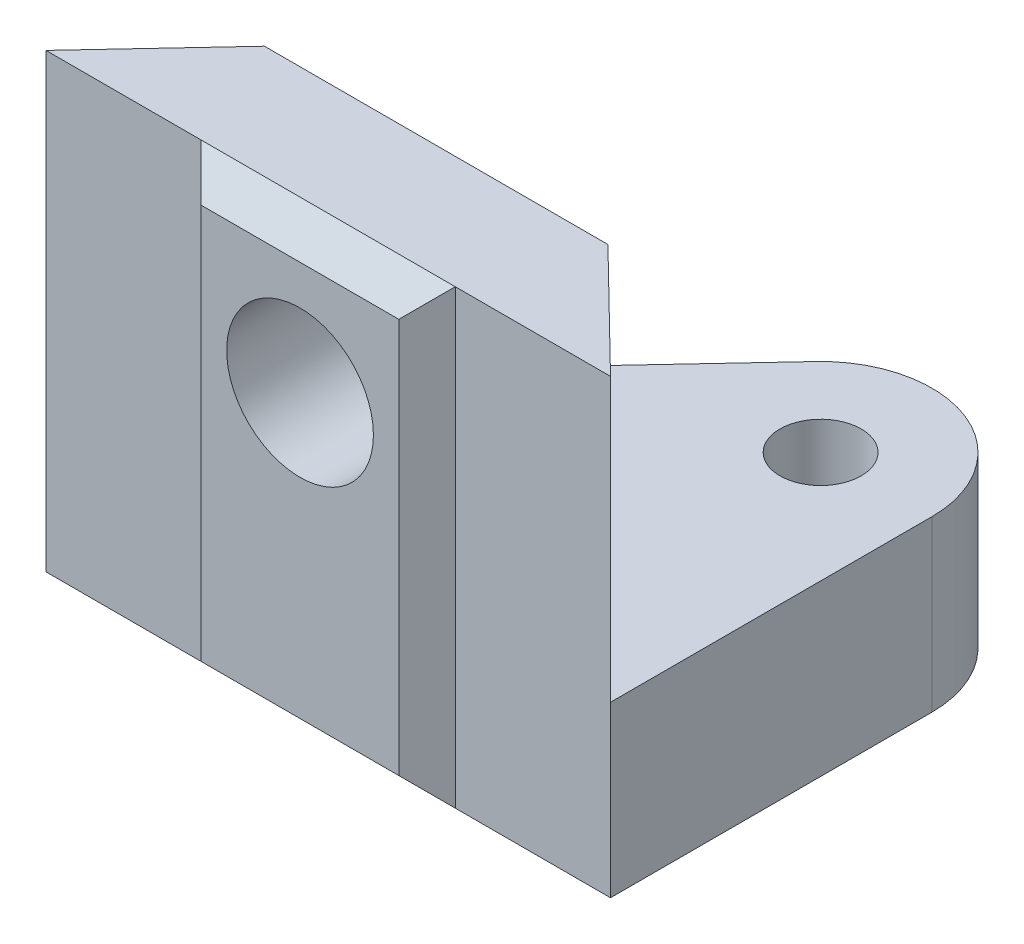
ISO-10303-21;
HEADER;
FILE_DESCRIPTION(('STEP AP214'),'2;1');
FILE_NAME('part.step','',(''),(''),'','','');
FILE_SCHEMA(('AUTOMOTIVE_DESIGN { 1 0 10303 214 1 1 1 1 }'));
ENDSEC;
DATA;
#1=APPLICATION_CONTEXT('core data for automotive mechanical design processes');
#2=APPLICATION_PROTOCOL_DEFINITION('international standard','automotive_design',2000,#1);
#3=PRODUCT_CONTEXT('',#1,'mechanical');
#4=PRODUCT('Part','Part','',(#3));
#5=PRODUCT_RELATED_PRODUCT_CATEGORY('part','',(#4));
#6=PRODUCT_DEFINITION_FORMATION('','',#4);
#7=PRODUCT_DEFINITION_CONTEXT('part definition',#1,'design');
#8=PRODUCT_DEFINITION('design','',#6,#7);
#9=PRODUCT_DEFINITION_SHAPE('','',#8);
#10=(LENGTH_UNIT() NAMED_UNIT(*) SI_UNIT(.MILLI.,.METRE.));
#11=(NAMED_UNIT(*) PLANE_ANGLE_UNIT() SI_UNIT($,.RADIAN.));
#12=(NAMED_UNIT(*) SI_UNIT($,.STERADIAN.) SOLID_ANGLE_UNIT());
#13=UNCERTAINTY_MEASURE_WITH_UNIT(LENGTH_MEASURE(1.E-05),#10,'distance_accuracy_value','');
#14=(GEOMETRIC_REPRESENTATION_CONTEXT(3) GLOBAL_UNCERTAINTY_ASSIGNED_CONTEXT((#13)) GLOBAL_UNIT_ASSIGNED_CONTEXT((#10,
#11,#12)) REPRESENTATION_CONTEXT('',''));
#15=CARTESIAN_POINT('',(0.,0.,0.));
#16=DIRECTION('',(0.,0.,1.));
#17=DIRECTION('',(1.,0.,0.));
#18=AXIS2_PLACEMENT_3D('',#15,#16,#17);
#19=CARTESIAN_POINT('',(13.4577263984075,-16.,4.73794596647533));
#20=DIRECTION('',(0.69905627403006,0.,-0.715066658248873));
#21=DIRECTION('',(-0.715066658248873,0.,-0.69905627403006));
#22=AXIS2_PLACEMENT_3D('',#19,#20,#21);
#23=PLANE('',#22);
#24=DIRECTION('',(0.,1.,0.));
#25=VECTOR('',#24,1.);
#26=CARTESIAN_POINT('',(13.4577263984075,-16.,4.73794596647533));
#27=LINE('',#26,#25);
#28=CARTESIAN_POINT('',(13.4577263984075,-10.,4.73794596647533));
#29=VERTEX_POINT('',#28);
#30=CARTESIAN_POINT('',(13.4577263984075,0.,4.73794596647533));
#31=VERTEX_POINT('',#30);
#32=EDGE_CURVE('E219',#29,#31,#27,.T.);
#33=ORIENTED_EDGE('',*,*,#32,.F.);
#34=DIRECTION('',(-0.715066658248873,0.,-0.69905627403006));
#35=VECTOR('',#34,1.);
#36=CARTESIAN_POINT('',(13.4577263984075,-10.,4.73794596647533));
#37=LINE('',#36,#35);
#38=CARTESIAN_POINT('',(9.3661149799074,-10.,0.737945966475324));
#39=VERTEX_POINT('',#38);
#40=EDGE_CURVE('E58',#29,#39,#37,.T.);
#41=ORIENTED_EDGE('',*,*,#40,.T.);
#42=DIRECTION('',(0.,1.,0.));
#43=VECTOR('',#42,1.);
#44=CARTESIAN_POINT('',(9.3661149799074,-16.,0.737945966475324));
#45=LINE('',#44,#43);
#46=CARTESIAN_POINT('',(9.3661149799074,0.,0.737945966475324));
#47=VERTEX_POINT('',#46);
#48=EDGE_CURVE('E42',#39,#47,#45,.T.);
#49=ORIENTED_EDGE('',*,*,#48,.T.);
#50=DIRECTION('',(-0.715066658248873,0.,-0.69905627403006));
#51=VECTOR('',#50,1.);
#52=CARTESIAN_POINT('',(13.4577263984075,0.,4.73794596647533));
#53=LINE('',#52,#51);
#54=EDGE_CURVE('E212',#31,#47,#53,.T.);
#55=ORIENTED_EDGE('',*,*,#54,.F.);
#56=EDGE_LOOP('',(#33,#41,#49,#55));
#57=FACE_BOUND('',#56,.T.);
#58=ADVANCED_FACE('F33',(#57),#23,.T.);
#59=CARTESIAN_POINT('',(-6.54227360159254,-16.,4.73794596647533));
#60=DIRECTION('',(0.,0.,1.));
#61=DIRECTION('',(1.,0.,0.));
#62=AXIS2_PLACEMENT_3D('',#59,#60,#61);
#63=PLANE('',#62);
#64=CARTESIAN_POINT('',(13.4577263984075,-16.,4.73794596647533));
#65=VERTEX_POINT('',#64);
#66=EDGE_CURVE('E217',#65,#29,#27,.T.);
#67=ORIENTED_EDGE('',*,*,#66,.T.);
#68=ORIENTED_EDGE('',*,*,#32,.T.);
#69=DIRECTION('',(1.,0.,0.));
#70=VECTOR('',#69,1.);
#71=CARTESIAN_POINT('',(-6.54227360159254,0.,4.73794596647533));
#72=LINE('',#71,#70);
#73=CARTESIAN_POINT('',(7.95772639840746,0.,4.73794596647533));
#74=VERTEX_POINT('',#73);
#75=EDGE_CURVE('E208',#74,#31,#72,.T.);
#76=ORIENTED_EDGE('',*,*,#75,.F.);
#77=DIRECTION('',(0.,1.,0.));
#78=VECTOR('',#77,1.);
#79=CARTESIAN_POINT('',(7.95772639840746,-16.,4.73794596647533));
#80=LINE('',#79,#78);
#81=CARTESIAN_POINT('',(7.95772639840746,-16.,4.73794596647533));
#82=VERTEX_POINT('',#81);
#83=EDGE_CURVE('E172',#82,#74,#80,.T.);
#84=ORIENTED_EDGE('',*,*,#83,.F.);
#85=DIRECTION('',(1.,0.,0.));
#86=VECTOR('',#85,1.);
#87=CARTESIAN_POINT('',(-6.54227360159254,-16.,4.73794596647533));
#88=LINE('',#87,#86);
#89=EDGE_CURVE('E199',#82,#65,#88,.T.);
#90=ORIENTED_EDGE('',*,*,#89,.T.);
#91=EDGE_LOOP('',(#67,#68,#76,#84,#90));
#92=FACE_BOUND('',#91,.T.);
#93=ADVANCED_FACE('F258',(#92),#63,.T.);
#94=CARTESIAN_POINT('',(-2.80088502009259,-16.,0.737945966475324));
#95=DIRECTION('',(-0.730321227553398,0.,-0.683103875398828));
#96=DIRECTION('',(-0.683103875398828,0.,0.730321227553398));
#97=AXIS2_PLACEMENT_3D('',#94,#95,#96);
#98=PLANE('',#97);
#99=DIRECTION('',(-0.683103875398828,0.,0.730321227553398));
#100=VECTOR('',#99,1.);
#101=CARTESIAN_POINT('',(-2.80088502009259,0.,0.737945966475324));
#102=LINE('',#101,#100);
#103=CARTESIAN_POINT('',(-2.80088502009259,0.,0.737945966475324));
#104=VERTEX_POINT('',#103);
#105=CARTESIAN_POINT('',(-6.54227360159254,0.,4.73794596647533));
#106=VERTEX_POINT('',#105);
#107=EDGE_CURVE('E178',#104,#106,#102,.T.);
#108=ORIENTED_EDGE('',*,*,#107,.F.);
#109=DIRECTION('',(0.,1.,0.));
#110=VECTOR('',#109,1.);
#111=CARTESIAN_POINT('',(-2.80088502009259,-16.,0.737945966475324));
#112=LINE('',#111,#110);
#113=CARTESIAN_POINT('',(-2.80088502009259,-16.,0.737945966475324));
#114=VERTEX_POINT('',#113);
#115=EDGE_CURVE('E11',#114,#104,#112,.T.);
#116=ORIENTED_EDGE('',*,*,#115,.F.);
#117=DIRECTION('',(-0.683103875398828,0.,0.730321227553398));
#118=VECTOR('',#117,1.);
#119=CARTESIAN_POINT('',(-2.80088502009259,-16.,0.737945966475324));
#120=LINE('',#119,#118);
#121=CARTESIAN_POINT('',(-6.54227360159254,-16.,4.73794596647533));
#122=VERTEX_POINT('',#121);
#123=EDGE_CURVE('E196',#114,#122,#120,.T.);
#124=ORIENTED_EDGE('',*,*,#123,.T.);
#125=DIRECTION('',(0.,1.,0.));
#126=VECTOR('',#125,1.);
#127=CARTESIAN_POINT('',(-6.54227360159254,-16.,4.73794596647533));
#128=LINE('',#127,#126);
#129=EDGE_CURVE('E37',#122,#106,#128,.T.);
#130=ORIENTED_EDGE('',*,*,#129,.T.);
#131=EDGE_LOOP('',(#108,#116,#124,#130));
#132=FACE_BOUND('',#131,.T.);
#133=ADVANCED_FACE('F35',(#132),#98,.T.);
#134=CARTESIAN_POINT('',(9.3661149799074,-16.,0.737945966475324));
#135=DIRECTION('',(0.,0.,-1.));
#136=DIRECTION('',(-1.,0.,0.));
#137=AXIS2_PLACEMENT_3D('',#134,#135,#136);
#138=PLANE('',#137);
#139=DIRECTION('',(0.,1.,0.));
#140=VECTOR('',#139,1.);
#141=CARTESIAN_POINT('',(-2.80044929092743,-16.,0.737945966475324));
#142=LINE('',#141,#140);
#143=CARTESIAN_POINT('',(-2.80044929092742,-16.,0.737945966475323));
#144=VERTEX_POINT('',#143);
#145=CARTESIAN_POINT('',(-2.80044929092743,-10.,0.737945966475324));
#146=VERTEX_POINT('',#145);
#147=EDGE_CURVE('E126',#144,#146,#142,.T.);
#148=ORIENTED_EDGE('',*,*,#147,.F.);
#149=DIRECTION('',(-1.,0.,0.));
#150=VECTOR('',#149,1.);
#151=CARTESIAN_POINT('',(9.3661149799074,-16.,0.737945966475324));
#152=LINE('',#151,#150);
#153=EDGE_CURVE('E204',#144,#114,#152,.T.);
#154=ORIENTED_EDGE('',*,*,#153,.T.);
#155=ORIENTED_EDGE('',*,*,#115,.T.);
#156=DIRECTION('',(-1.,0.,0.));
#157=VECTOR('',#156,1.);
#158=CARTESIAN_POINT('',(9.3661149799074,0.,0.737945966475324));
#159=LINE('',#158,#157);
#160=EDGE_CURVE('E200',#47,#104,#159,.T.);
#161=ORIENTED_EDGE('',*,*,#160,.F.);
#162=ORIENTED_EDGE('',*,*,#48,.F.);
#163=DIRECTION('',(-1.,0.,0.));
#164=VECTOR('',#163,1.);
#165=CARTESIAN_POINT('',(9.3661149799074,-10.,0.737945966475324));
#166=LINE('',#165,#164);
#167=EDGE_CURVE('E50',#39,#146,#166,.T.);
#168=ORIENTED_EDGE('',*,*,#167,.T.);
#169=EDGE_LOOP('',(#148,#154,#155,#161,#162,#168));
#170=FACE_BOUND('',#169,.T.);
#171=CARTESIAN_POINT('',(3.45772639840746,-5.,0.737945966475324));
#172=DIRECTION('',(0.,0.,1.));
#173=DIRECTION('',(1.,0.,0.));
#174=AXIS2_PLACEMENT_3D('',#171,#172,#173);
#175=CIRCLE('',#174,2.6);
#176=CARTESIAN_POINT('',(6.05772639840746,-5.,0.737945966475324));
#177=VERTEX_POINT('',#176);
#178=EDGE_CURVE('E159',#177,#177,#175,.T.);
#179=ORIENTED_EDGE('',*,*,#178,.T.);
#180=EDGE_LOOP('',(#179));
#181=FACE_BOUND('',#180,.T.);
#182=ADVANCED_FACE('F237',(#170,#181),#138,.T.);
#183=CARTESIAN_POINT('',(-1.04227360159254,-16.,4.73794596647533));
#184=VERTEX_POINT('',#183);
#185=EDGE_CURVE('E201',#122,#184,#88,.T.);
#186=ORIENTED_EDGE('',*,*,#185,.T.);
#187=DIRECTION('',(0.,-1.,0.));
#188=VECTOR('',#187,1.);
#189=CARTESIAN_POINT('',(-1.04227360159254,0.,4.73794596647533));
#190=LINE('',#189,#188);
#191=CARTESIAN_POINT('',(-1.04227360159254,0.,4.73794596647533));
#192=VERTEX_POINT('',#191);
#193=EDGE_CURVE('E167',#192,#184,#190,.T.);
#194=ORIENTED_EDGE('',*,*,#193,.F.);
#195=EDGE_CURVE('E209',#106,#192,#72,.T.);
#196=ORIENTED_EDGE('',*,*,#195,.F.);
#197=ORIENTED_EDGE('',*,*,#129,.F.);
#198=EDGE_LOOP('',(#186,#194,#196,#197));
#199=FACE_BOUND('',#198,.T.);
#200=ADVANCED_FACE('F231',(#199),#63,.T.);
#201=CARTESIAN_POINT('',(0.,-16.,0.));
#202=DIRECTION('',(0.,-1.,0.));
#203=DIRECTION('',(0.,0.,-1.));
#204=AXIS2_PLACEMENT_3D('',#201,#202,#203);
#205=PLANE('',#204);
#206=ORIENTED_EDGE('',*,*,#153,.F.);
#207=DIRECTION('',(0.683146304419613,0.,-0.730281539379044));
#208=VECTOR('',#207,1.);
#209=CARTESIAN_POINT('',(-6.54227360159254,-16.,4.73794596647533));
#210=LINE('',#209,#208);
#211=CARTESIAN_POINT('',(6.63176572555713,-16.,-9.34506620446005));
#212=VERTEX_POINT('',#211);
#213=EDGE_CURVE('E148',#144,#212,#210,.T.);
#214=ORIENTED_EDGE('',*,*,#213,.T.);
#215=CARTESIAN_POINT('',(9.51272639840746,-16.,-6.65005403352468));
#216=DIRECTION('',(0.,-1.,0.));
#217=DIRECTION('',(0.,0.,-1.));
#218=AXIS2_PLACEMENT_3D('',#215,#216,#217);
#219=CIRCLE('',#218,3.945);
#220=CARTESIAN_POINT('',(13.4577263984075,-16.,-6.65005403352468));
#221=VERTEX_POINT('',#220);
#222=EDGE_CURVE('E137',#212,#221,#219,.T.);
#223=ORIENTED_EDGE('',*,*,#222,.T.);
#224=DIRECTION('',(0.,0.,1.));
#225=VECTOR('',#224,1.);
#226=CARTESIAN_POINT('',(13.4577263984075,-16.,4.73794596647533));
#227=LINE('',#226,#225);
#228=EDGE_CURVE('E130',#221,#65,#227,.T.);
#229=ORIENTED_EDGE('',*,*,#228,.T.);
#230=ORIENTED_EDGE('',*,*,#89,.F.);
#231=DIRECTION('',(1.,0.,0.));
#232=VECTOR('',#231,1.);
#233=CARTESIAN_POINT('',(-1.04227360159254,-16.,4.73794596647533));
#234=LINE('',#233,#232);
#235=EDGE_CURVE('E169',#184,#82,#234,.T.);
#236=ORIENTED_EDGE('',*,*,#235,.F.);
#237=ORIENTED_EDGE('',*,*,#185,.F.);
#238=ORIENTED_EDGE('',*,*,#123,.F.);
#239=EDGE_LOOP('',(#206,#214,#223,#229,#230,#236,#237,#238));
#240=FACE_BOUND('',#239,.T.);
#241=CARTESIAN_POINT('',(9.51272639840746,-16.,-6.65005403352468));
#242=DIRECTION('',(0.,-1.,0.));
#243=DIRECTION('',(0.,0.,-1.));
#244=AXIS2_PLACEMENT_3D('',#241,#242,#243);
#245=CIRCLE('',#244,1.44);
#246=CARTESIAN_POINT('',(9.51272639840746,-16.,-8.09005403352467));
#247=VERTEX_POINT('',#246);
#248=EDGE_CURVE('E407',#247,#247,#245,.T.);
#249=ORIENTED_EDGE('',*,*,#248,.F.);
#250=EDGE_LOOP('',(#249));
#251=FACE_BOUND('',#250,.T.);
#252=ADVANCED_FACE('F241',(#240,#251),#205,.T.);
#253=CARTESIAN_POINT('',(0.,0.,0.));
#254=DIRECTION('',(0.,-1.,0.));
#255=DIRECTION('',(0.,0.,-1.));
#256=AXIS2_PLACEMENT_3D('',#253,#254,#255);
#257=PLANE('',#256);
#258=ORIENTED_EDGE('',*,*,#107,.T.);
#259=ORIENTED_EDGE('',*,*,#195,.T.);
#260=DIRECTION('',(-1.,0.,0.));
#261=VECTOR('',#260,1.);
#262=CARTESIAN_POINT('',(7.95772639840746,0.,4.73794596647533));
#263=LINE('',#262,#261);
#264=EDGE_CURVE('E162',#74,#192,#263,.T.);
#265=ORIENTED_EDGE('',*,*,#264,.F.);
#266=ORIENTED_EDGE('',*,*,#75,.T.);
#267=ORIENTED_EDGE('',*,*,#54,.T.);
#268=ORIENTED_EDGE('',*,*,#160,.T.);
#269=EDGE_LOOP('',(#258,#259,#265,#266,#267,#268));
#270=FACE_BOUND('',#269,.T.);
#271=ADVANCED_FACE('F234',(#270),#257,.F.);
#272=CARTESIAN_POINT('',(7.95772639840746,0.,4.73794596647533));
#273=DIRECTION('',(0.,0.707106781186546,0.707106781186549));
#274=DIRECTION('',(0.,-0.707106781186549,0.707106781186546));
#275=AXIS2_PLACEMENT_3D('',#272,#273,#274);
#276=PLANE('',#275);
#277=ORIENTED_EDGE('',*,*,#264,.T.);
#278=DIRECTION('',(-0.577350269189627,0.577350269189627,-0.577350269189624));
#279=VECTOR('',#278,1.);
#280=CARTESIAN_POINT('',(-1.04227360159254,0.,4.73794596647533));
#281=LINE('',#280,#279);
#282=CARTESIAN_POINT('',(-0.0422736015925408,-1.,5.73794596647533));
#283=VERTEX_POINT('',#282);
#284=EDGE_CURVE('E175',#283,#192,#281,.T.);
#285=ORIENTED_EDGE('',*,*,#284,.F.);
#286=DIRECTION('',(1.,0.,0.));
#287=VECTOR('',#286,1.);
#288=CARTESIAN_POINT('',(7.95772639840746,-1.,5.73794596647533));
#289=LINE('',#288,#287);
#290=CARTESIAN_POINT('',(6.95772639840745,-1.,5.73794596647533));
#291=VERTEX_POINT('',#290);
#292=EDGE_CURVE('E174',#291,#283,#289,.F.);
#293=ORIENTED_EDGE('',*,*,#292,.F.);
#294=DIRECTION('',(0.577350269189627,0.577350269189627,-0.577350269189624));
#295=VECTOR('',#294,1.);
#296=CARTESIAN_POINT('',(7.95772639840746,0.,4.73794596647533));
#297=LINE('',#296,#295);
#298=EDGE_CURVE('E180',#291,#74,#297,.T.);
#299=ORIENTED_EDGE('',*,*,#298,.T.);
#300=EDGE_LOOP('',(#277,#285,#293,#299));
#301=FACE_BOUND('',#300,.T.);
#302=ADVANCED_FACE('F255',(#301),#276,.T.);
#303=CARTESIAN_POINT('',(-1.04227360159254,0.,4.73794596647533));
#304=DIRECTION('',(-0.707106781186546,0.,0.707106781186549));
#305=DIRECTION('',(0.707106781186549,0.,0.707106781186546));
#306=AXIS2_PLACEMENT_3D('',#303,#304,#305);
#307=PLANE('',#306);
#308=ORIENTED_EDGE('',*,*,#193,.T.);
#309=DIRECTION('',(-0.577350269189626,-0.577350269189627,-0.577350269189624));
#310=VECTOR('',#309,1.);
#311=CARTESIAN_POINT('',(-1.04227360159254,-16.,4.73794596647533));
#312=LINE('',#311,#310);
#313=CARTESIAN_POINT('',(-0.0422736015925392,-15.,5.73794596647533));
#314=VERTEX_POINT('',#313);
#315=EDGE_CURVE('E179',#314,#184,#312,.T.);
#316=ORIENTED_EDGE('',*,*,#315,.F.);
#317=DIRECTION('',(0.,1.,0.));
#318=VECTOR('',#317,1.);
#319=CARTESIAN_POINT('',(-0.042273601592541,0.,5.73794596647533));
#320=LINE('',#319,#318);
#321=EDGE_CURVE('E191',#283,#314,#320,.F.);
#322=ORIENTED_EDGE('',*,*,#321,.F.);
#323=ORIENTED_EDGE('',*,*,#284,.T.);
#324=EDGE_LOOP('',(#308,#316,#322,#323));
#325=FACE_BOUND('',#324,.T.);
#326=ADVANCED_FACE('F251',(#325),#307,.T.);
#327=CARTESIAN_POINT('',(-1.04227360159254,-16.,4.73794596647533));
#328=DIRECTION('',(0.,-0.707106781186546,0.707106781186549));
#329=DIRECTION('',(0.,-0.707106781186549,-0.707106781186546));
#330=AXIS2_PLACEMENT_3D('',#327,#328,#329);
#331=PLANE('',#330);
#332=ORIENTED_EDGE('',*,*,#235,.T.);
#333=DIRECTION('',(0.577350269189627,-0.577350269189627,-0.577350269189624));
#334=VECTOR('',#333,1.);
#335=CARTESIAN_POINT('',(7.95772639840746,-16.,4.73794596647533));
#336=LINE('',#335,#334);
#337=CARTESIAN_POINT('',(6.95772639840745,-15.,5.73794596647533));
#338=VERTEX_POINT('',#337);
#339=EDGE_CURVE('E183',#338,#82,#336,.T.);
#340=ORIENTED_EDGE('',*,*,#339,.F.);
#341=DIRECTION('',(-1.,0.,0.));
#342=VECTOR('',#341,1.);
#343=CARTESIAN_POINT('',(-1.04227360159254,-15.,5.73794596647533));
#344=LINE('',#343,#342);
#345=EDGE_CURVE('E193',#314,#338,#344,.F.);
#346=ORIENTED_EDGE('',*,*,#345,.F.);
#347=ORIENTED_EDGE('',*,*,#315,.T.);
#348=EDGE_LOOP('',(#332,#340,#346,#347));
#349=FACE_BOUND('',#348,.T.);
#350=ADVANCED_FACE('F249',(#349),#331,.T.);
#351=CARTESIAN_POINT('',(7.95772639840746,-16.,4.73794596647533));
#352=DIRECTION('',(0.707106781186546,0.,0.707106781186549));
#353=DIRECTION('',(0.707106781186549,0.,-0.707106781186546));
#354=AXIS2_PLACEMENT_3D('',#351,#352,#353);
#355=PLANE('',#354);
#356=ORIENTED_EDGE('',*,*,#83,.T.);
#357=ORIENTED_EDGE('',*,*,#298,.F.);
#358=DIRECTION('',(0.,-1.,0.));
#359=VECTOR('',#358,1.);
#360=CARTESIAN_POINT('',(6.95772639840745,-16.,5.73794596647533));
#361=LINE('',#360,#359);
#362=EDGE_CURVE('E184',#338,#291,#361,.F.);
#363=ORIENTED_EDGE('',*,*,#362,.F.);
#364=ORIENTED_EDGE('',*,*,#339,.T.);
#365=EDGE_LOOP('',(#356,#357,#363,#364));
#366=FACE_BOUND('',#365,.T.);
#367=ADVANCED_FACE('F309',(#366),#355,.T.);
#368=CARTESIAN_POINT('',(0.,0.,5.73794596647533));
#369=DIRECTION('',(0.,0.,1.));
#370=DIRECTION('',(1.,0.,0.));
#371=AXIS2_PLACEMENT_3D('',#368,#369,#370);
#372=PLANE('',#371);
#373=CARTESIAN_POINT('',(3.45772639840746,-5.,5.73794596647533));
#374=DIRECTION('',(0.,0.,1.));
#375=DIRECTION('',(1.,0.,0.));
#376=AXIS2_PLACEMENT_3D('',#373,#374,#375);
#377=CIRCLE('',#376,2.6);
#378=CARTESIAN_POINT('',(6.05772639840746,-5.,5.73794596647533));
#379=VERTEX_POINT('',#378);
#380=EDGE_CURVE('E158',#379,#379,#377,.T.);
#381=ORIENTED_EDGE('',*,*,#380,.F.);
#382=EDGE_LOOP('',(#381));
#383=FACE_BOUND('',#382,.T.);
#384=ORIENTED_EDGE('',*,*,#292,.T.);
#385=ORIENTED_EDGE('',*,*,#321,.T.);
#386=ORIENTED_EDGE('',*,*,#345,.T.);
#387=ORIENTED_EDGE('',*,*,#362,.T.);
#388=EDGE_LOOP('',(#384,#385,#386,#387));
#389=FACE_BOUND('',#388,.T.);
#390=ADVANCED_FACE('F298',(#383,#389),#372,.T.);
#391=CARTESIAN_POINT('',(3.45772639840746,-5.,0.737945966475324));
#392=DIRECTION('',(0.,0.,1.));
#393=DIRECTION('',(1.,0.,0.));
#394=AXIS2_PLACEMENT_3D('',#391,#392,#393);
#395=CYLINDRICAL_SURFACE('',#394,2.6);
#396=ORIENTED_EDGE('',*,*,#178,.F.);
#397=EDGE_LOOP('',(#396));
#398=FACE_BOUND('',#397,.T.);
#399=ORIENTED_EDGE('',*,*,#380,.T.);
#400=EDGE_LOOP('',(#399));
#401=FACE_BOUND('',#400,.T.);
#402=ADVANCED_FACE('F293',(#398,#401),#395,.F.);
#403=CARTESIAN_POINT('',(13.4577263984075,-10.,4.73794596647533));
#404=DIRECTION('',(1.,0.,0.));
#405=DIRECTION('',(0.,0.,-1.));
#406=AXIS2_PLACEMENT_3D('',#403,#404,#405);
#407=PLANE('',#406);
#408=ORIENTED_EDGE('',*,*,#228,.F.);
#409=DIRECTION('',(0.,-1.,0.));
#410=VECTOR('',#409,1.);
#411=CARTESIAN_POINT('',(13.4577263984075,-10.,-6.65005403352468));
#412=LINE('',#411,#410);
#413=CARTESIAN_POINT('',(13.4577263984075,-10.,-6.65005403352468));
#414=VERTEX_POINT('',#413);
#415=EDGE_CURVE('E138',#414,#221,#412,.T.);
#416=ORIENTED_EDGE('',*,*,#415,.F.);
#417=DIRECTION('',(0.,0.,1.));
#418=VECTOR('',#417,1.);
#419=CARTESIAN_POINT('',(13.4577263984075,-10.,4.73794596647533));
#420=LINE('',#419,#418);
#421=EDGE_CURVE('E139',#414,#29,#420,.T.);
#422=ORIENTED_EDGE('',*,*,#421,.T.);
#423=ORIENTED_EDGE('',*,*,#66,.F.);
#424=EDGE_LOOP('',(#408,#416,#422,#423));
#425=FACE_BOUND('',#424,.T.);
#426=ADVANCED_FACE('F297',(#425),#407,.T.);
#427=CARTESIAN_POINT('',(9.51272639840746,-10.,-6.65005403352468));
#428=DIRECTION('',(0.,-1.,0.));
#429=DIRECTION('',(0.,0.,-1.));
#430=AXIS2_PLACEMENT_3D('',#427,#428,#429);
#431=CYLINDRICAL_SURFACE('',#430,3.945);
#432=ORIENTED_EDGE('',*,*,#222,.F.);
#433=DIRECTION('',(0.,-1.,0.));
#434=VECTOR('',#433,1.);
#435=CARTESIAN_POINT('',(6.63176572555713,-10.,-9.34506620446005));
#436=LINE('',#435,#434);
#437=CARTESIAN_POINT('',(6.63176572555713,-10.,-9.34506620446005));
#438=VERTEX_POINT('',#437);
#439=EDGE_CURVE('E124',#438,#212,#436,.T.);
#440=ORIENTED_EDGE('',*,*,#439,.F.);
#441=CARTESIAN_POINT('',(9.51272639840746,-10.,-6.65005403352468));
#442=DIRECTION('',(0.,-1.,0.));
#443=DIRECTION('',(0.,0.,-1.));
#444=AXIS2_PLACEMENT_3D('',#441,#442,#443);
#445=CIRCLE('',#444,3.945);
#446=EDGE_CURVE('E129',#438,#414,#445,.T.);
#447=ORIENTED_EDGE('',*,*,#446,.T.);
#448=ORIENTED_EDGE('',*,*,#415,.T.);
#449=EDGE_LOOP('',(#432,#440,#447,#448));
#450=FACE_BOUND('',#449,.T.);
#451=ADVANCED_FACE('F134',(#450),#431,.T.);
#452=CARTESIAN_POINT('',(-6.54227360159254,-10.,4.73794596647533));
#453=DIRECTION('',(-0.730281539379044,0.,-0.683146304419613));
#454=DIRECTION('',(-0.683146304419613,0.,0.730281539379044));
#455=AXIS2_PLACEMENT_3D('',#452,#453,#454);
#456=PLANE('',#455);
#457=ORIENTED_EDGE('',*,*,#213,.F.);
#458=ORIENTED_EDGE('',*,*,#147,.T.);
#459=DIRECTION('',(0.683146304419613,0.,-0.730281539379044));
#460=VECTOR('',#459,1.);
#461=CARTESIAN_POINT('',(-6.54227360159254,-10.,4.73794596647533));
#462=LINE('',#461,#460);
#463=EDGE_CURVE('E120',#146,#438,#462,.T.);
#464=ORIENTED_EDGE('',*,*,#463,.T.);
#465=ORIENTED_EDGE('',*,*,#439,.T.);
#466=EDGE_LOOP('',(#457,#458,#464,#465));
#467=FACE_BOUND('',#466,.T.);
#468=ADVANCED_FACE('F123',(#467),#456,.T.);
#469=CARTESIAN_POINT('',(9.51272639840746,-10.,-6.65005403352468));
#470=DIRECTION('',(0.,-1.,0.));
#471=DIRECTION('',(0.,0.,-1.));
#472=AXIS2_PLACEMENT_3D('',#469,#470,#471);
#473=PLANE('',#472);
#474=ORIENTED_EDGE('',*,*,#167,.F.);
#475=ORIENTED_EDGE('',*,*,#40,.F.);
#476=ORIENTED_EDGE('',*,*,#421,.F.);
#477=ORIENTED_EDGE('',*,*,#446,.F.);
#478=ORIENTED_EDGE('',*,*,#463,.F.);
#479=EDGE_LOOP('',(#474,#475,#476,#477,#478));
#480=FACE_BOUND('',#479,.T.);
#481=CARTESIAN_POINT('',(9.51272639840746,-10.,-6.65005403352468));
#482=DIRECTION('',(0.,-1.,0.));
#483=DIRECTION('',(0.,0.,-1.));
#484=AXIS2_PLACEMENT_3D('',#481,#482,#483);
#485=CIRCLE('',#484,1.44);
#486=CARTESIAN_POINT('',(9.51272639840746,-10.,-8.09005403352467));
#487=VERTEX_POINT('',#486);
#488=EDGE_CURVE('E150',#487,#487,#485,.T.);
#489=ORIENTED_EDGE('',*,*,#488,.T.);
#490=EDGE_LOOP('',(#489));
#491=FACE_BOUND('',#490,.T.);
#492=ADVANCED_FACE('F141',(#480,#491),#473,.F.);
#493=CARTESIAN_POINT('',(9.51272639840746,-10.,-6.65005403352468));
#494=DIRECTION('',(0.,-1.,0.));
#495=DIRECTION('',(0.,0.,-1.));
#496=AXIS2_PLACEMENT_3D('',#493,#494,#495);
#497=CYLINDRICAL_SURFACE('',#496,1.44);
#498=ORIENTED_EDGE('',*,*,#488,.F.);
#499=EDGE_LOOP('',(#498));
#500=FACE_BOUND('',#499,.T.);
#501=ORIENTED_EDGE('',*,*,#248,.T.);
#502=EDGE_LOOP('',(#501));
#503=FACE_BOUND('',#502,.T.);
#504=ADVANCED_FACE('F389',(#500,#503),#497,.F.);
#505=CLOSED_SHELL('',(#58,#93,#133,#182,#200,#252,#271,#302,#326,#350,#367,#390,#402,#426,#451,
#468,#492,#504));
#506=MANIFOLD_SOLID_BREP('B2',#505);
#507=ADVANCED_BREP_SHAPE_REPRESENTATION('',(#18,#506),#14);
#508=SHAPE_DEFINITION_REPRESENTATION(#9,#507);
ENDSEC;
END-ISO-10303-21;
